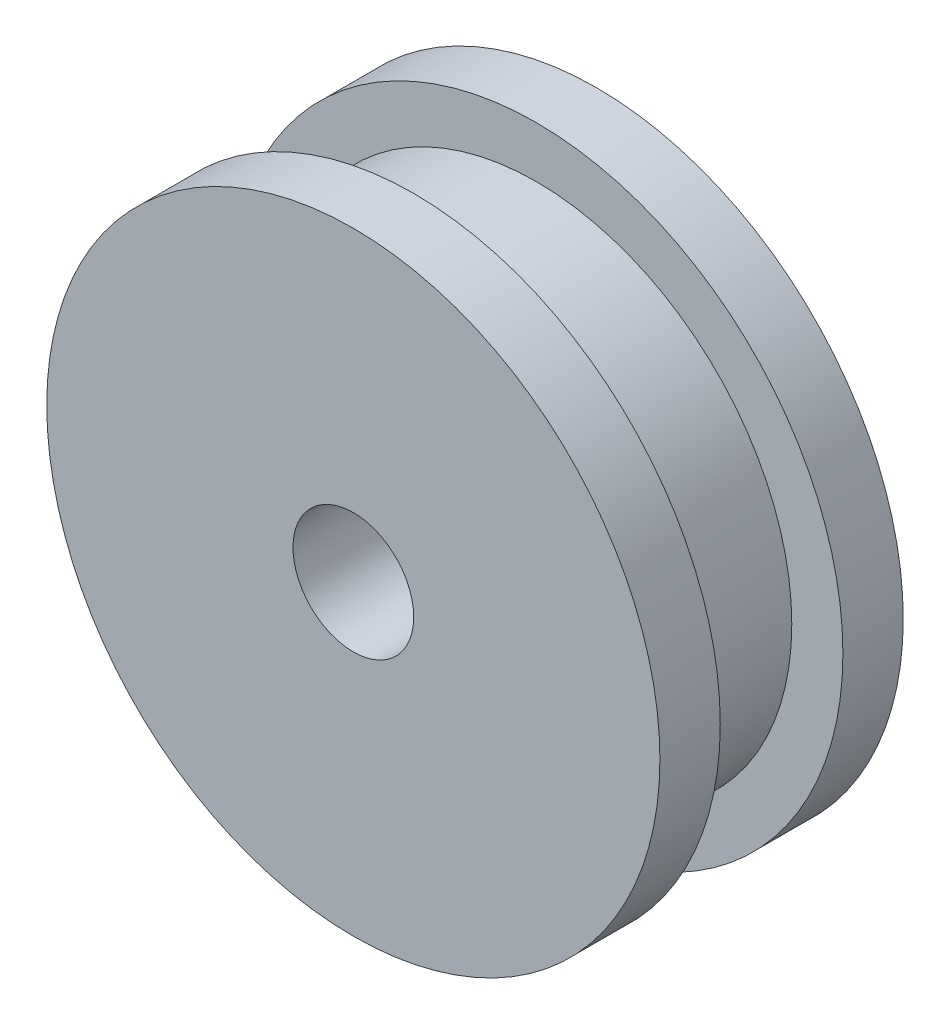
ISO-10303-21;
HEADER;
FILE_DESCRIPTION(('STEP AP214'),'2;1');
FILE_NAME('part.step','',(''),(''),'','','');
FILE_SCHEMA(('AUTOMOTIVE_DESIGN { 1 0 10303 214 1 1 1 1 }'));
ENDSEC;
DATA;
#1=APPLICATION_CONTEXT('core data for automotive mechanical design processes');
#2=APPLICATION_PROTOCOL_DEFINITION('international standard','automotive_design',2000,#1);
#3=PRODUCT_CONTEXT('',#1,'mechanical');
#4=PRODUCT('Part','Part','',(#3));
#5=PRODUCT_RELATED_PRODUCT_CATEGORY('part','',(#4));
#6=PRODUCT_DEFINITION_FORMATION('','',#4);
#7=PRODUCT_DEFINITION_CONTEXT('part definition',#1,'design');
#8=PRODUCT_DEFINITION('design','',#6,#7);
#9=PRODUCT_DEFINITION_SHAPE('','',#8);
#10=(LENGTH_UNIT() NAMED_UNIT(*) SI_UNIT(.MILLI.,.METRE.));
#11=(NAMED_UNIT(*) PLANE_ANGLE_UNIT() SI_UNIT($,.RADIAN.));
#12=(NAMED_UNIT(*) SI_UNIT($,.STERADIAN.) SOLID_ANGLE_UNIT());
#13=UNCERTAINTY_MEASURE_WITH_UNIT(LENGTH_MEASURE(1.E-05),#10,'distance_accuracy_value','');
#14=(GEOMETRIC_REPRESENTATION_CONTEXT(3) GLOBAL_UNCERTAINTY_ASSIGNED_CONTEXT((#13)) GLOBAL_UNIT_ASSIGNED_CONTEXT((#10,
#11,#12)) REPRESENTATION_CONTEXT('',''));
#15=CARTESIAN_POINT('',(0.,0.,0.));
#16=DIRECTION('',(0.,0.,1.));
#17=DIRECTION('',(1.,0.,0.));
#18=AXIS2_PLACEMENT_3D('',#15,#16,#17);
#19=CARTESIAN_POINT('',(0.,0.,3.048));
#20=DIRECTION('',(0.,0.,-1.));
#21=DIRECTION('',(-1.,0.,0.));
#22=AXIS2_PLACEMENT_3D('',#19,#20,#21);
#23=CYLINDRICAL_SURFACE('',#22,12.7);
#24=CARTESIAN_POINT('',(0.,0.,3.048));
#25=DIRECTION('',(0.,0.,1.));
#26=DIRECTION('',(1.,0.,0.));
#27=AXIS2_PLACEMENT_3D('',#24,#25,#26);
#28=CIRCLE('',#27,12.7);
#29=CARTESIAN_POINT('',(12.7,0.,3.048));
#30=VERTEX_POINT('',#29);
#31=EDGE_CURVE('E10',#30,#30,#28,.T.);
#32=ORIENTED_EDGE('',*,*,#31,.F.);
#33=EDGE_LOOP('',(#32));
#34=FACE_BOUND('',#33,.T.);
#35=CARTESIAN_POINT('',(0.,0.,-3.048));
#36=DIRECTION('',(0.,0.,-1.));
#37=DIRECTION('',(-1.,0.,0.));
#38=AXIS2_PLACEMENT_3D('',#35,#36,#37);
#39=CIRCLE('',#38,12.7);
#40=CARTESIAN_POINT('',(-12.7,0.,-3.048));
#41=VERTEX_POINT('',#40);
#42=EDGE_CURVE('E45',#41,#41,#39,.T.);
#43=ORIENTED_EDGE('',*,*,#42,.F.);
#44=EDGE_LOOP('',(#43));
#45=FACE_BOUND('',#44,.T.);
#46=ADVANCED_FACE('F30',(#34,#45),#23,.T.);
#47=CARTESIAN_POINT('',(0.,0.,6.048));
#48=DIRECTION('',(0.,0.,-1.));
#49=DIRECTION('',(-1.,0.,0.));
#50=AXIS2_PLACEMENT_3D('',#47,#48,#49);
#51=CYLINDRICAL_SURFACE('',#50,15.24);
#52=CARTESIAN_POINT('',(0.,0.,6.048));
#53=DIRECTION('',(0.,0.,1.));
#54=DIRECTION('',(1.,0.,0.));
#55=AXIS2_PLACEMENT_3D('',#52,#53,#54);
#56=CIRCLE('',#55,15.24);
#57=CARTESIAN_POINT('',(15.24,0.,6.048));
#58=VERTEX_POINT('',#57);
#59=EDGE_CURVE('E37',#58,#58,#56,.T.);
#60=ORIENTED_EDGE('',*,*,#59,.F.);
#61=EDGE_LOOP('',(#60));
#62=FACE_BOUND('',#61,.T.);
#63=CARTESIAN_POINT('',(0.,0.,3.048));
#64=DIRECTION('',(0.,0.,1.));
#65=DIRECTION('',(1.,0.,0.));
#66=AXIS2_PLACEMENT_3D('',#63,#64,#65);
#67=CIRCLE('',#66,15.24);
#68=CARTESIAN_POINT('',(15.24,0.,3.048));
#69=VERTEX_POINT('',#68);
#70=EDGE_CURVE('E41',#69,#69,#67,.T.);
#71=ORIENTED_EDGE('',*,*,#70,.T.);
#72=EDGE_LOOP('',(#71));
#73=FACE_BOUND('',#72,.T.);
#74=ADVANCED_FACE('F86',(#62,#73),#51,.T.);
#75=CARTESIAN_POINT('',(0.,0.,6.048));
#76=DIRECTION('',(0.,0.,1.));
#77=DIRECTION('',(1.,0.,0.));
#78=AXIS2_PLACEMENT_3D('',#75,#76,#77);
#79=PLANE('',#78);
#80=CARTESIAN_POINT('',(0.,0.,6.048));
#81=DIRECTION('',(0.,0.,1.));
#82=DIRECTION('',(1.,0.,0.));
#83=AXIS2_PLACEMENT_3D('',#80,#81,#82);
#84=CIRCLE('',#83,3.);
#85=CARTESIAN_POINT('',(3.,0.,6.048));
#86=VERTEX_POINT('',#85);
#87=EDGE_CURVE('E55',#86,#86,#84,.T.);
#88=ORIENTED_EDGE('',*,*,#87,.F.);
#89=EDGE_LOOP('',(#88));
#90=FACE_BOUND('',#89,.T.);
#91=ORIENTED_EDGE('',*,*,#59,.T.);
#92=EDGE_LOOP('',(#91));
#93=FACE_BOUND('',#92,.T.);
#94=ADVANCED_FACE('F91',(#90,#93),#79,.T.);
#95=CARTESIAN_POINT('',(0.,0.,3.048));
#96=DIRECTION('',(0.,0.,1.));
#97=DIRECTION('',(1.,0.,0.));
#98=AXIS2_PLACEMENT_3D('',#95,#96,#97);
#99=PLANE('',#98);
#100=ORIENTED_EDGE('',*,*,#31,.T.);
#101=EDGE_LOOP('',(#100));
#102=FACE_BOUND('',#101,.T.);
#103=ORIENTED_EDGE('',*,*,#70,.F.);
#104=EDGE_LOOP('',(#103));
#105=FACE_BOUND('',#104,.T.);
#106=ADVANCED_FACE('F74',(#102,#105),#99,.F.);
#107=CARTESIAN_POINT('',(0.,0.,-6.048));
#108=DIRECTION('',(0.,0.,1.));
#109=DIRECTION('',(1.,0.,0.));
#110=AXIS2_PLACEMENT_3D('',#107,#108,#109);
#111=CYLINDRICAL_SURFACE('',#110,15.24);
#112=CARTESIAN_POINT('',(0.,0.,-6.048));
#113=DIRECTION('',(0.,0.,1.));
#114=DIRECTION('',(1.,0.,0.));
#115=AXIS2_PLACEMENT_3D('',#112,#113,#114);
#116=CIRCLE('',#115,15.24);
#117=CARTESIAN_POINT('',(15.24,0.,-6.048));
#118=VERTEX_POINT('',#117);
#119=EDGE_CURVE('E49',#118,#118,#116,.T.);
#120=ORIENTED_EDGE('',*,*,#119,.T.);
#121=EDGE_LOOP('',(#120));
#122=FACE_BOUND('',#121,.T.);
#123=CARTESIAN_POINT('',(0.,0.,-3.048));
#124=DIRECTION('',(0.,0.,1.));
#125=DIRECTION('',(1.,0.,0.));
#126=AXIS2_PLACEMENT_3D('',#123,#124,#125);
#127=CIRCLE('',#126,15.24);
#128=CARTESIAN_POINT('',(15.24,0.,-3.048));
#129=VERTEX_POINT('',#128);
#130=EDGE_CURVE('E50',#129,#129,#127,.T.);
#131=ORIENTED_EDGE('',*,*,#130,.F.);
#132=EDGE_LOOP('',(#131));
#133=FACE_BOUND('',#132,.T.);
#134=ADVANCED_FACE('F68',(#122,#133),#111,.T.);
#135=CARTESIAN_POINT('',(0.,0.,-6.048));
#136=DIRECTION('',(0.,0.,-1.));
#137=DIRECTION('',(1.,0.,0.));
#138=AXIS2_PLACEMENT_3D('',#135,#136,#137);
#139=PLANE('',#138);
#140=CARTESIAN_POINT('',(0.,0.,-6.048));
#141=DIRECTION('',(0.,0.,-1.));
#142=DIRECTION('',(-1.,0.,0.));
#143=AXIS2_PLACEMENT_3D('',#140,#141,#142);
#144=CIRCLE('',#143,3.);
#145=CARTESIAN_POINT('',(-3.,0.,-6.048));
#146=VERTEX_POINT('',#145);
#147=EDGE_CURVE('E33',#146,#146,#144,.T.);
#148=ORIENTED_EDGE('',*,*,#147,.F.);
#149=EDGE_LOOP('',(#148));
#150=FACE_BOUND('',#149,.T.);
#151=ORIENTED_EDGE('',*,*,#119,.F.);
#152=EDGE_LOOP('',(#151));
#153=FACE_BOUND('',#152,.T.);
#154=ADVANCED_FACE('F64',(#150,#153),#139,.T.);
#155=CARTESIAN_POINT('',(0.,0.,-3.048));
#156=DIRECTION('',(0.,0.,-1.));
#157=DIRECTION('',(1.,0.,0.));
#158=AXIS2_PLACEMENT_3D('',#155,#156,#157);
#159=PLANE('',#158);
#160=ORIENTED_EDGE('',*,*,#42,.T.);
#161=EDGE_LOOP('',(#160));
#162=FACE_BOUND('',#161,.T.);
#163=ORIENTED_EDGE('',*,*,#130,.T.);
#164=EDGE_LOOP('',(#163));
#165=FACE_BOUND('',#164,.T.);
#166=ADVANCED_FACE('F67',(#162,#165),#159,.F.);
#167=CARTESIAN_POINT('',(0.,0.,-19.558));
#168=DIRECTION('',(0.,0.,1.));
#169=DIRECTION('',(1.,0.,0.));
#170=AXIS2_PLACEMENT_3D('',#167,#168,#169);
#171=CYLINDRICAL_SURFACE('',#170,3.);
#172=ORIENTED_EDGE('',*,*,#147,.T.);
#173=EDGE_LOOP('',(#172));
#174=FACE_BOUND('',#173,.T.);
#175=ORIENTED_EDGE('',*,*,#87,.T.);
#176=EDGE_LOOP('',(#175));
#177=FACE_BOUND('',#176,.T.);
#178=ADVANCED_FACE('F62',(#174,#177),#171,.F.);
#179=CLOSED_SHELL('',(#46,#74,#94,#106,#134,#154,#166,#178));
#180=MANIFOLD_SOLID_BREP('B2',#179);
#181=ADVANCED_BREP_SHAPE_REPRESENTATION('',(#18,#180),#14);
#182=SHAPE_DEFINITION_REPRESENTATION(#9,#181);
ENDSEC;
END-ISO-10303-21;
